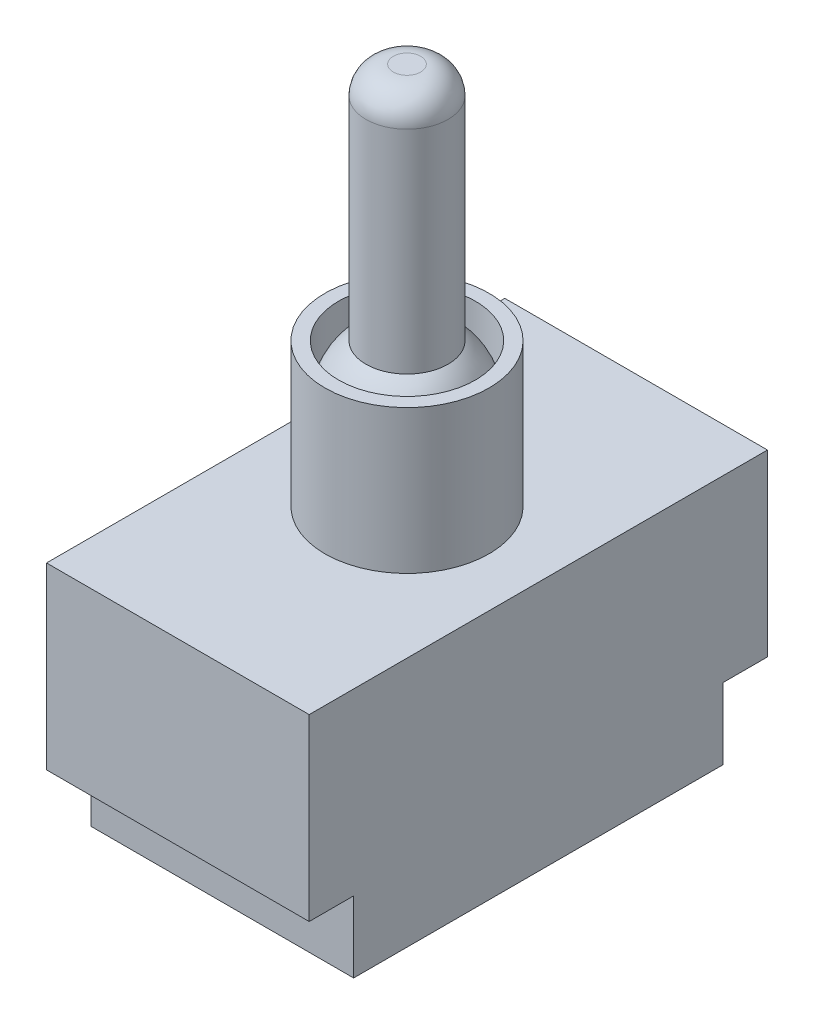
ISO-10303-21;
HEADER;
FILE_DESCRIPTION(('STEP AP214'),'2;1');
FILE_NAME('part.step','',(''),(''),'','','');
FILE_SCHEMA(('AUTOMOTIVE_DESIGN { 1 0 10303 214 1 1 1 1 }'));
ENDSEC;
DATA;
#1=APPLICATION_CONTEXT('core data for automotive mechanical design processes');
#2=APPLICATION_PROTOCOL_DEFINITION('international standard','automotive_design',2000,#1);
#3=PRODUCT_CONTEXT('',#1,'mechanical');
#4=PRODUCT('Part','Part','',(#3));
#5=PRODUCT_RELATED_PRODUCT_CATEGORY('part','',(#4));
#6=PRODUCT_DEFINITION_FORMATION('','',#4);
#7=PRODUCT_DEFINITION_CONTEXT('part definition',#1,'design');
#8=PRODUCT_DEFINITION('design','',#6,#7);
#9=PRODUCT_DEFINITION_SHAPE('','',#8);
#10=(LENGTH_UNIT() NAMED_UNIT(*) SI_UNIT(.MILLI.,.METRE.));
#11=(NAMED_UNIT(*) PLANE_ANGLE_UNIT() SI_UNIT($,.RADIAN.));
#12=(NAMED_UNIT(*) SI_UNIT($,.STERADIAN.) SOLID_ANGLE_UNIT());
#13=UNCERTAINTY_MEASURE_WITH_UNIT(LENGTH_MEASURE(1.E-05),#10,'distance_accuracy_value','');
#14=(GEOMETRIC_REPRESENTATION_CONTEXT(3) GLOBAL_UNCERTAINTY_ASSIGNED_CONTEXT((#13)) GLOBAL_UNIT_ASSIGNED_CONTEXT((#10,
#11,#12)) REPRESENTATION_CONTEXT('',''));
#15=CARTESIAN_POINT('',(0.,0.,0.));
#16=DIRECTION('',(0.,0.,1.));
#17=DIRECTION('',(1.,0.,0.));
#18=AXIS2_PLACEMENT_3D('',#15,#16,#17);
#19=CARTESIAN_POINT('',(0.,0.,0.));
#20=DIRECTION('',(0.,1.,0.));
#21=DIRECTION('',(0.,0.,1.));
#22=AXIS2_PLACEMENT_3D('',#19,#20,#21);
#23=PLANE('',#22);
#24=DIRECTION('',(-1.,0.,0.));
#25=VECTOR('',#24,1.);
#26=CARTESIAN_POINT('',(9.6,0.,13.5));
#27=LINE('',#26,#25);
#28=CARTESIAN_POINT('',(9.6,0.,13.5));
#29=VERTEX_POINT('',#28);
#30=CARTESIAN_POINT('',(-9.6,0.,13.5));
#31=VERTEX_POINT('',#30);
#32=EDGE_CURVE('E49',#29,#31,#27,.T.);
#33=ORIENTED_EDGE('',*,*,#32,.F.);
#34=DIRECTION('',(0.,0.,-1.));
#35=VECTOR('',#34,1.);
#36=CARTESIAN_POINT('',(9.6,0.,16.75));
#37=LINE('',#36,#35);
#38=CARTESIAN_POINT('',(9.6,0.,16.75));
#39=VERTEX_POINT('',#38);
#40=EDGE_CURVE('E156',#39,#29,#37,.T.);
#41=ORIENTED_EDGE('',*,*,#40,.F.);
#42=DIRECTION('',(1.,0.,0.));
#43=VECTOR('',#42,1.);
#44=CARTESIAN_POINT('',(9.6,0.,16.75));
#45=LINE('',#44,#43);
#46=CARTESIAN_POINT('',(-9.6,0.,16.75));
#47=VERTEX_POINT('',#46);
#48=EDGE_CURVE('E153',#47,#39,#45,.T.);
#49=ORIENTED_EDGE('',*,*,#48,.F.);
#50=DIRECTION('',(0.,0.,1.));
#51=VECTOR('',#50,1.);
#52=CARTESIAN_POINT('',(-9.6,0.,16.75));
#53=LINE('',#52,#51);
#54=EDGE_CURVE('E54',#31,#47,#53,.T.);
#55=ORIENTED_EDGE('',*,*,#54,.F.);
#56=EDGE_LOOP('',(#33,#41,#49,#55));
#57=FACE_BOUND('',#56,.T.);
#58=ADVANCED_FACE('F34',(#57),#23,.F.);
#59=DIRECTION('',(1.,0.,0.));
#60=VECTOR('',#59,1.);
#61=CARTESIAN_POINT('',(9.6,0.,-13.5));
#62=LINE('',#61,#60);
#63=CARTESIAN_POINT('',(-9.6,0.,-13.5));
#64=VERTEX_POINT('',#63);
#65=CARTESIAN_POINT('',(9.6,0.,-13.5));
#66=VERTEX_POINT('',#65);
#67=EDGE_CURVE('E326',#64,#66,#62,.T.);
#68=ORIENTED_EDGE('',*,*,#67,.F.);
#69=CARTESIAN_POINT('',(-9.6,0.,-16.75));
#70=VERTEX_POINT('',#69);
#71=EDGE_CURVE('E123',#70,#64,#53,.T.);
#72=ORIENTED_EDGE('',*,*,#71,.F.);
#73=DIRECTION('',(-1.,0.,0.));
#74=VECTOR('',#73,1.);
#75=CARTESIAN_POINT('',(9.6,0.,-16.75));
#76=LINE('',#75,#74);
#77=CARTESIAN_POINT('',(9.6,0.,-16.75));
#78=VERTEX_POINT('',#77);
#79=EDGE_CURVE('E145',#78,#70,#76,.T.);
#80=ORIENTED_EDGE('',*,*,#79,.F.);
#81=EDGE_CURVE('E155',#66,#78,#37,.T.);
#82=ORIENTED_EDGE('',*,*,#81,.F.);
#83=EDGE_LOOP('',(#68,#72,#80,#82));
#84=FACE_BOUND('',#83,.T.);
#85=ADVANCED_FACE('F189',(#84),#23,.F.);
#86=CARTESIAN_POINT('',(-9.6,13.1,16.75));
#87=DIRECTION('',(1.,0.,0.));
#88=DIRECTION('',(0.,0.,-1.));
#89=AXIS2_PLACEMENT_3D('',#86,#87,#88);
#90=PLANE('',#89);
#91=ORIENTED_EDGE('',*,*,#71,.T.);
#92=DIRECTION('',(0.,1.,0.));
#93=VECTOR('',#92,1.);
#94=CARTESIAN_POINT('',(-9.6,-5.2,-13.5));
#95=LINE('',#94,#93);
#96=CARTESIAN_POINT('',(-9.6,-5.2,-13.5));
#97=VERTEX_POINT('',#96);
#98=EDGE_CURVE('E103',#97,#64,#95,.T.);
#99=ORIENTED_EDGE('',*,*,#98,.F.);
#100=DIRECTION('',(0.,0.,-1.));
#101=VECTOR('',#100,1.);
#102=CARTESIAN_POINT('',(-9.6,-5.2,13.5));
#103=LINE('',#102,#101);
#104=CARTESIAN_POINT('',(-9.6,-5.2,13.5));
#105=VERTEX_POINT('',#104);
#106=EDGE_CURVE('E109',#105,#97,#103,.T.);
#107=ORIENTED_EDGE('',*,*,#106,.F.);
#108=DIRECTION('',(0.,1.,0.));
#109=VECTOR('',#108,1.);
#110=CARTESIAN_POINT('',(-9.6,-5.2,13.5));
#111=LINE('',#110,#109);
#112=EDGE_CURVE('E324',#105,#31,#111,.T.);
#113=ORIENTED_EDGE('',*,*,#112,.T.);
#114=ORIENTED_EDGE('',*,*,#54,.T.);
#115=DIRECTION('',(0.,-1.,0.));
#116=VECTOR('',#115,1.);
#117=CARTESIAN_POINT('',(-9.6,13.1,16.75));
#118=LINE('',#117,#116);
#119=CARTESIAN_POINT('',(-9.6,13.1,16.75));
#120=VERTEX_POINT('',#119);
#121=EDGE_CURVE('E166',#120,#47,#118,.T.);
#122=ORIENTED_EDGE('',*,*,#121,.F.);
#123=DIRECTION('',(0.,0.,1.));
#124=VECTOR('',#123,1.);
#125=CARTESIAN_POINT('',(-9.6,13.1,16.75));
#126=LINE('',#125,#124);
#127=CARTESIAN_POINT('',(-9.6,13.1,-16.75));
#128=VERTEX_POINT('',#127);
#129=EDGE_CURVE('E141',#128,#120,#126,.T.);
#130=ORIENTED_EDGE('',*,*,#129,.F.);
#131=DIRECTION('',(0.,-1.,0.));
#132=VECTOR('',#131,1.);
#133=CARTESIAN_POINT('',(-9.6,13.1,-16.75));
#134=LINE('',#133,#132);
#135=EDGE_CURVE('E151',#128,#70,#134,.T.);
#136=ORIENTED_EDGE('',*,*,#135,.T.);
#137=EDGE_LOOP('',(#91,#99,#107,#113,#114,#122,#130,#136));
#138=FACE_BOUND('',#137,.T.);
#139=ADVANCED_FACE('F120',(#138),#90,.F.);
#140=CARTESIAN_POINT('',(9.6,13.1,16.75));
#141=DIRECTION('',(0.,0.,-1.));
#142=DIRECTION('',(-1.,0.,0.));
#143=AXIS2_PLACEMENT_3D('',#140,#141,#142);
#144=PLANE('',#143);
#145=ORIENTED_EDGE('',*,*,#48,.T.);
#146=DIRECTION('',(0.,-1.,0.));
#147=VECTOR('',#146,1.);
#148=CARTESIAN_POINT('',(9.6,13.1,16.75));
#149=LINE('',#148,#147);
#150=CARTESIAN_POINT('',(9.6,13.1,16.75));
#151=VERTEX_POINT('',#150);
#152=EDGE_CURVE('E163',#151,#39,#149,.T.);
#153=ORIENTED_EDGE('',*,*,#152,.F.);
#154=DIRECTION('',(1.,0.,0.));
#155=VECTOR('',#154,1.);
#156=CARTESIAN_POINT('',(9.6,13.1,16.75));
#157=LINE('',#156,#155);
#158=EDGE_CURVE('E144',#120,#151,#157,.T.);
#159=ORIENTED_EDGE('',*,*,#158,.F.);
#160=ORIENTED_EDGE('',*,*,#121,.T.);
#161=EDGE_LOOP('',(#145,#153,#159,#160));
#162=FACE_BOUND('',#161,.T.);
#163=ADVANCED_FACE('F206',(#162),#144,.F.);
#164=CARTESIAN_POINT('',(9.6,13.1,16.75));
#165=DIRECTION('',(-1.,0.,0.));
#166=DIRECTION('',(0.,0.,1.));
#167=AXIS2_PLACEMENT_3D('',#164,#165,#166);
#168=PLANE('',#167);
#169=ORIENTED_EDGE('',*,*,#40,.T.);
#170=DIRECTION('',(0.,1.,0.));
#171=VECTOR('',#170,1.);
#172=CARTESIAN_POINT('',(9.6,-5.2,13.5));
#173=LINE('',#172,#171);
#174=CARTESIAN_POINT('',(9.6,-5.2,13.5));
#175=VERTEX_POINT('',#174);
#176=EDGE_CURVE('E129',#175,#29,#173,.T.);
#177=ORIENTED_EDGE('',*,*,#176,.F.);
#178=DIRECTION('',(0.,0.,1.));
#179=VECTOR('',#178,1.);
#180=CARTESIAN_POINT('',(9.6,-5.2,13.5));
#181=LINE('',#180,#179);
#182=CARTESIAN_POINT('',(9.6,-5.2,-13.5));
#183=VERTEX_POINT('',#182);
#184=EDGE_CURVE('E108',#183,#175,#181,.T.);
#185=ORIENTED_EDGE('',*,*,#184,.F.);
#186=DIRECTION('',(0.,1.,0.));
#187=VECTOR('',#186,1.);
#188=CARTESIAN_POINT('',(9.6,-5.2,-13.5));
#189=LINE('',#188,#187);
#190=EDGE_CURVE('E105',#183,#66,#189,.T.);
#191=ORIENTED_EDGE('',*,*,#190,.T.);
#192=ORIENTED_EDGE('',*,*,#81,.T.);
#193=DIRECTION('',(0.,-1.,0.));
#194=VECTOR('',#193,1.);
#195=CARTESIAN_POINT('',(9.6,13.1,-16.75));
#196=LINE('',#195,#194);
#197=CARTESIAN_POINT('',(9.6,13.1,-16.75));
#198=VERTEX_POINT('',#197);
#199=EDGE_CURVE('E160',#198,#78,#196,.T.);
#200=ORIENTED_EDGE('',*,*,#199,.F.);
#201=DIRECTION('',(0.,0.,-1.));
#202=VECTOR('',#201,1.);
#203=CARTESIAN_POINT('',(9.6,13.1,16.75));
#204=LINE('',#203,#202);
#205=EDGE_CURVE('E147',#151,#198,#204,.T.);
#206=ORIENTED_EDGE('',*,*,#205,.F.);
#207=ORIENTED_EDGE('',*,*,#152,.T.);
#208=EDGE_LOOP('',(#169,#177,#185,#191,#192,#200,#206,#207));
#209=FACE_BOUND('',#208,.T.);
#210=ADVANCED_FACE('F202',(#209),#168,.F.);
#211=CARTESIAN_POINT('',(9.6,13.1,-16.75));
#212=DIRECTION('',(0.,0.,1.));
#213=DIRECTION('',(1.,0.,0.));
#214=AXIS2_PLACEMENT_3D('',#211,#212,#213);
#215=PLANE('',#214);
#216=ORIENTED_EDGE('',*,*,#79,.T.);
#217=ORIENTED_EDGE('',*,*,#135,.F.);
#218=DIRECTION('',(-1.,0.,0.));
#219=VECTOR('',#218,1.);
#220=CARTESIAN_POINT('',(9.6,13.1,-16.75));
#221=LINE('',#220,#219);
#222=EDGE_CURVE('E149',#198,#128,#221,.T.);
#223=ORIENTED_EDGE('',*,*,#222,.F.);
#224=ORIENTED_EDGE('',*,*,#199,.T.);
#225=EDGE_LOOP('',(#216,#217,#223,#224));
#226=FACE_BOUND('',#225,.T.);
#227=ADVANCED_FACE('F199',(#226),#215,.F.);
#228=CARTESIAN_POINT('',(0.,13.1,0.));
#229=DIRECTION('',(0.,1.,0.));
#230=DIRECTION('',(0.,0.,1.));
#231=AXIS2_PLACEMENT_3D('',#228,#229,#230);
#232=PLANE('',#231);
#233=CARTESIAN_POINT('',(0.,13.1,0.));
#234=DIRECTION('',(0.,1.,0.));
#235=DIRECTION('',(0.,0.,1.));
#236=AXIS2_PLACEMENT_3D('',#233,#234,#235);
#237=CIRCLE('',#236,6.);
#238=CARTESIAN_POINT('',(0.,13.1,6.));
#239=VERTEX_POINT('',#238);
#240=EDGE_CURVE('E134',#239,#239,#237,.T.);
#241=ORIENTED_EDGE('',*,*,#240,.F.);
#242=EDGE_LOOP('',(#241));
#243=FACE_BOUND('',#242,.T.);
#244=ORIENTED_EDGE('',*,*,#129,.T.);
#245=ORIENTED_EDGE('',*,*,#158,.T.);
#246=ORIENTED_EDGE('',*,*,#205,.T.);
#247=ORIENTED_EDGE('',*,*,#222,.T.);
#248=EDGE_LOOP('',(#244,#245,#246,#247));
#249=FACE_BOUND('',#248,.T.);
#250=ADVANCED_FACE('F197',(#243,#249),#232,.T.);
#251=CARTESIAN_POINT('',(0.,23.6,0.));
#252=DIRECTION('',(0.,-1.,0.));
#253=DIRECTION('',(0.,0.,-1.));
#254=AXIS2_PLACEMENT_3D('',#251,#252,#253);
#255=CYLINDRICAL_SURFACE('',#254,6.);
#256=CARTESIAN_POINT('',(0.,23.6,0.));
#257=DIRECTION('',(0.,1.,0.));
#258=DIRECTION('',(0.,0.,1.));
#259=AXIS2_PLACEMENT_3D('',#256,#257,#258);
#260=CIRCLE('',#259,6.);
#261=CARTESIAN_POINT('',(0.,23.6,6.));
#262=VERTEX_POINT('',#261);
#263=EDGE_CURVE('E136',#262,#262,#260,.T.);
#264=ORIENTED_EDGE('',*,*,#263,.F.);
#265=EDGE_LOOP('',(#264));
#266=FACE_BOUND('',#265,.T.);
#267=ORIENTED_EDGE('',*,*,#240,.T.);
#268=EDGE_LOOP('',(#267));
#269=FACE_BOUND('',#268,.T.);
#270=ADVANCED_FACE('F234',(#266,#269),#255,.T.);
#271=CARTESIAN_POINT('',(0.,23.6,0.));
#272=DIRECTION('',(0.,1.,0.));
#273=DIRECTION('',(0.,0.,1.));
#274=AXIS2_PLACEMENT_3D('',#271,#272,#273);
#275=PLANE('',#274);
#276=CARTESIAN_POINT('',(0.,23.6,0.));
#277=DIRECTION('',(0.,1.,0.));
#278=DIRECTION('',(0.,0.,1.));
#279=AXIS2_PLACEMENT_3D('',#276,#277,#278);
#280=CIRCLE('',#279,5.);
#281=CARTESIAN_POINT('',(0.,23.6,5.));
#282=VERTEX_POINT('',#281);
#283=EDGE_CURVE('E124',#282,#282,#280,.T.);
#284=ORIENTED_EDGE('',*,*,#283,.F.);
#285=EDGE_LOOP('',(#284));
#286=FACE_BOUND('',#285,.T.);
#287=ORIENTED_EDGE('',*,*,#263,.T.);
#288=EDGE_LOOP('',(#287));
#289=FACE_BOUND('',#288,.T.);
#290=ADVANCED_FACE('F241',(#286,#289),#275,.T.);
#291=CARTESIAN_POINT('',(0.,19.6,0.));
#292=DIRECTION('',(0.,1.,0.));
#293=DIRECTION('',(0.,0.,1.));
#294=AXIS2_PLACEMENT_3D('',#291,#292,#293);
#295=CYLINDRICAL_SURFACE('',#294,5.);
#296=CARTESIAN_POINT('',(0.,19.6,0.));
#297=DIRECTION('',(0.,1.,0.));
#298=DIRECTION('',(0.,0.,1.));
#299=AXIS2_PLACEMENT_3D('',#296,#297,#298);
#300=CIRCLE('',#299,5.);
#301=CARTESIAN_POINT('',(0.,19.6,5.));
#302=VERTEX_POINT('',#301);
#303=EDGE_CURVE('E127',#302,#302,#300,.T.);
#304=ORIENTED_EDGE('',*,*,#303,.F.);
#305=EDGE_LOOP('',(#304));
#306=FACE_BOUND('',#305,.T.);
#307=ORIENTED_EDGE('',*,*,#283,.T.);
#308=EDGE_LOOP('',(#307));
#309=FACE_BOUND('',#308,.T.);
#310=ADVANCED_FACE('F248',(#306,#309),#295,.F.);
#311=CARTESIAN_POINT('',(0.,19.6,0.));
#312=DIRECTION('',(0.,0.,1.));
#313=DIRECTION('',(1.,0.,0.));
#314=AXIS2_PLACEMENT_3D('',#311,#312,#313);
#315=SPHERICAL_SURFACE('',#314,5.);
#316=CARTESIAN_POINT('',(0.,19.6,0.));
#317=DIRECTION('',(0.,1.,0.));
#318=DIRECTION('',(0.,0.,1.));
#319=AXIS2_PLACEMENT_3D('',#316,#317,#318);
#320=SPHERICAL_SURFACE('',#319,5.);
#321=ORIENTED_EDGE('',*,*,#303,.T.);
#322=EDGE_LOOP('',(#321));
#323=FACE_BOUND('',#322,.T.);
#324=CARTESIAN_POINT('',(0.,23.6,0.));
#325=DIRECTION('',(0.,-1.,0.));
#326=DIRECTION('',(0.,0.,-1.));
#327=AXIS2_PLACEMENT_3D('',#324,#325,#326);
#328=CIRCLE('',#327,3.);
#329=CARTESIAN_POINT('',(0.,23.6,-3.));
#330=VERTEX_POINT('',#329);
#331=EDGE_CURVE('E169',#330,#330,#328,.T.);
#332=ORIENTED_EDGE('',*,*,#331,.T.);
#333=EDGE_LOOP('',(#332));
#334=FACE_BOUND('',#333,.T.);
#335=ADVANCED_FACE('F256',(#323,#334),#320,.T.);
#336=CARTESIAN_POINT('',(0.,41.1,0.));
#337=DIRECTION('',(0.,1.,0.));
#338=DIRECTION('',(0.,0.,1.));
#339=AXIS2_PLACEMENT_3D('',#336,#337,#338);
#340=PLANE('',#339);
#341=CARTESIAN_POINT('',(0.,41.1,0.));
#342=DIRECTION('',(0.,1.,0.));
#343=DIRECTION('',(0.,0.,1.));
#344=AXIS2_PLACEMENT_3D('',#341,#342,#343);
#345=CIRCLE('',#344,1.);
#346=CARTESIAN_POINT('',(0.,41.1,1.));
#347=VERTEX_POINT('',#346);
#348=EDGE_CURVE('E42',#347,#347,#345,.T.);
#349=ORIENTED_EDGE('',*,*,#348,.T.);
#350=EDGE_LOOP('',(#349));
#351=FACE_BOUND('',#350,.T.);
#352=ADVANCED_FACE('F174',(#351),#340,.T.);
#353=CARTESIAN_POINT('',(0.,41.1,0.));
#354=DIRECTION('',(0.,-1.,0.));
#355=DIRECTION('',(0.,0.,-1.));
#356=AXIS2_PLACEMENT_3D('',#353,#354,#355);
#357=CYLINDRICAL_SURFACE('',#356,3.);
#358=CARTESIAN_POINT('',(0.,39.1,0.));
#359=DIRECTION('',(0.,1.,0.));
#360=DIRECTION('',(0.,0.,1.));
#361=AXIS2_PLACEMENT_3D('',#358,#359,#360);
#362=CIRCLE('',#361,3.);
#363=CARTESIAN_POINT('',(0.,39.1,3.));
#364=VERTEX_POINT('',#363);
#365=EDGE_CURVE('E11',#364,#364,#362,.F.);
#366=ORIENTED_EDGE('',*,*,#365,.T.);
#367=EDGE_LOOP('',(#366));
#368=FACE_BOUND('',#367,.T.);
#369=ORIENTED_EDGE('',*,*,#331,.F.);
#370=EDGE_LOOP('',(#369));
#371=FACE_BOUND('',#370,.T.);
#372=ADVANCED_FACE('F177',(#368,#371),#357,.T.);
#373=CARTESIAN_POINT('',(0.,39.1,0.));
#374=DIRECTION('',(0.,1.,0.));
#375=DIRECTION('',(0.,0.,1.));
#376=AXIS2_PLACEMENT_3D('',#373,#374,#375);
#377=DEGENERATE_TOROIDAL_SURFACE('',#376,1.,2.,.T.);
#378=ORIENTED_EDGE('',*,*,#365,.F.);
#379=EDGE_LOOP('',(#378));
#380=FACE_BOUND('',#379,.T.);
#381=ORIENTED_EDGE('',*,*,#348,.F.);
#382=EDGE_LOOP('',(#381));
#383=FACE_BOUND('',#382,.T.);
#384=ADVANCED_FACE('F36',(#380,#383),#377,.T.);
#385=CARTESIAN_POINT('',(9.6,-5.2,-13.5));
#386=DIRECTION('',(0.,0.,1.));
#387=DIRECTION('',(1.,0.,0.));
#388=AXIS2_PLACEMENT_3D('',#385,#386,#387);
#389=PLANE('',#388);
#390=ORIENTED_EDGE('',*,*,#67,.T.);
#391=ORIENTED_EDGE('',*,*,#190,.F.);
#392=DIRECTION('',(1.,0.,0.));
#393=VECTOR('',#392,1.);
#394=CARTESIAN_POINT('',(9.6,-5.2,-13.5));
#395=LINE('',#394,#393);
#396=EDGE_CURVE('E98',#97,#183,#395,.T.);
#397=ORIENTED_EDGE('',*,*,#396,.F.);
#398=ORIENTED_EDGE('',*,*,#98,.T.);
#399=EDGE_LOOP('',(#390,#391,#397,#398));
#400=FACE_BOUND('',#399,.T.);
#401=ADVANCED_FACE('F101',(#400),#389,.F.);
#402=CARTESIAN_POINT('',(9.6,-5.2,13.5));
#403=DIRECTION('',(0.,0.,-1.));
#404=DIRECTION('',(-1.,0.,0.));
#405=AXIS2_PLACEMENT_3D('',#402,#403,#404);
#406=PLANE('',#405);
#407=ORIENTED_EDGE('',*,*,#32,.T.);
#408=ORIENTED_EDGE('',*,*,#112,.F.);
#409=DIRECTION('',(-1.,0.,0.));
#410=VECTOR('',#409,1.);
#411=CARTESIAN_POINT('',(9.6,-5.2,13.5));
#412=LINE('',#411,#410);
#413=EDGE_CURVE('E114',#175,#105,#412,.T.);
#414=ORIENTED_EDGE('',*,*,#413,.F.);
#415=ORIENTED_EDGE('',*,*,#176,.T.);
#416=EDGE_LOOP('',(#407,#408,#414,#415));
#417=FACE_BOUND('',#416,.T.);
#418=ADVANCED_FACE('F183',(#417),#406,.F.);
#419=CARTESIAN_POINT('',(0.,-5.2,0.));
#420=DIRECTION('',(0.,1.,0.));
#421=DIRECTION('',(0.,0.,1.));
#422=AXIS2_PLACEMENT_3D('',#419,#420,#421);
#423=PLANE('',#422);
#424=ORIENTED_EDGE('',*,*,#106,.T.);
#425=ORIENTED_EDGE('',*,*,#396,.T.);
#426=ORIENTED_EDGE('',*,*,#184,.T.);
#427=ORIENTED_EDGE('',*,*,#413,.T.);
#428=EDGE_LOOP('',(#424,#425,#426,#427));
#429=FACE_BOUND('',#428,.T.);
#430=ADVANCED_FACE('F112',(#429),#423,.F.);
#431=CLOSED_SHELL('',(#58,#85,#139,#163,#210,#227,#250,#270,#290,#310,#335,#352,#372,#384,#401,
#418,#430));
#432=MANIFOLD_SOLID_BREP('B2',#431);
#433=ADVANCED_BREP_SHAPE_REPRESENTATION('',(#18,#432),#14);
#434=SHAPE_DEFINITION_REPRESENTATION(#9,#433);
ENDSEC;
END-ISO-10303-21;
